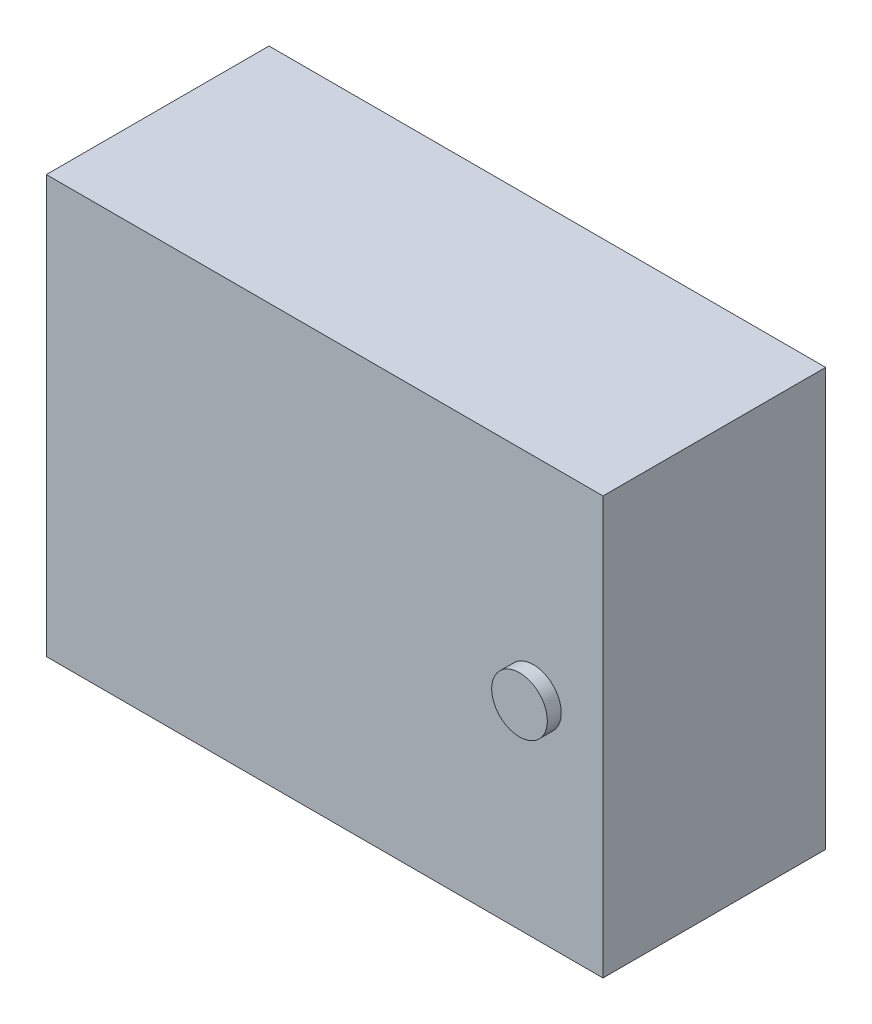
ISO-10303-21;
HEADER;
FILE_DESCRIPTION(('STEP AP214'),'2;1');
FILE_NAME('part.step','',(''),(''),'','','');
FILE_SCHEMA(('AUTOMOTIVE_DESIGN { 1 0 10303 214 1 1 1 1 }'));
ENDSEC;
DATA;
#1=APPLICATION_CONTEXT('core data for automotive mechanical design processes');
#2=APPLICATION_PROTOCOL_DEFINITION('international standard','automotive_design',2000,#1);
#3=PRODUCT_CONTEXT('',#1,'mechanical');
#4=PRODUCT('Part','Part','',(#3));
#5=PRODUCT_RELATED_PRODUCT_CATEGORY('part','',(#4));
#6=PRODUCT_DEFINITION_FORMATION('','',#4);
#7=PRODUCT_DEFINITION_CONTEXT('part definition',#1,'design');
#8=PRODUCT_DEFINITION('design','',#6,#7);
#9=PRODUCT_DEFINITION_SHAPE('','',#8);
#10=(LENGTH_UNIT() NAMED_UNIT(*) SI_UNIT(.MILLI.,.METRE.));
#11=(NAMED_UNIT(*) PLANE_ANGLE_UNIT() SI_UNIT($,.RADIAN.));
#12=(NAMED_UNIT(*) SI_UNIT($,.STERADIAN.) SOLID_ANGLE_UNIT());
#13=UNCERTAINTY_MEASURE_WITH_UNIT(LENGTH_MEASURE(1.E-05),#10,'distance_accuracy_value','');
#14=(GEOMETRIC_REPRESENTATION_CONTEXT(3) GLOBAL_UNCERTAINTY_ASSIGNED_CONTEXT((#13)) GLOBAL_UNIT_ASSIGNED_CONTEXT((#10,
#11,#12)) REPRESENTATION_CONTEXT('',''));
#15=CARTESIAN_POINT('',(0.,0.,0.));
#16=DIRECTION('',(0.,0.,1.));
#17=DIRECTION('',(1.,0.,0.));
#18=AXIS2_PLACEMENT_3D('',#15,#16,#17);
#19=CARTESIAN_POINT('',(200.,-150.,160.));
#20=DIRECTION('',(-1.,0.,0.));
#21=DIRECTION('',(0.,0.,1.));
#22=AXIS2_PLACEMENT_3D('',#19,#20,#21);
#23=PLANE('',#22);
#24=DIRECTION('',(0.,1.,0.));
#25=VECTOR('',#24,1.);
#26=CARTESIAN_POINT('',(200.,-150.,0.));
#27=LINE('',#26,#25);
#28=CARTESIAN_POINT('',(200.,-150.,0.));
#29=VERTEX_POINT('',#28);
#30=CARTESIAN_POINT('',(200.,150.,0.));
#31=VERTEX_POINT('',#30);
#32=EDGE_CURVE('E99',#29,#31,#27,.T.);
#33=ORIENTED_EDGE('',*,*,#32,.T.);
#34=DIRECTION('',(0.,0.,-1.));
#35=VECTOR('',#34,1.);
#36=CARTESIAN_POINT('',(200.,150.,160.));
#37=LINE('',#36,#35);
#38=CARTESIAN_POINT('',(200.,150.,160.));
#39=VERTEX_POINT('',#38);
#40=EDGE_CURVE('E41',#39,#31,#37,.T.);
#41=ORIENTED_EDGE('',*,*,#40,.F.);
#42=DIRECTION('',(0.,1.,0.));
#43=VECTOR('',#42,1.);
#44=CARTESIAN_POINT('',(200.,-150.,160.));
#45=LINE('',#44,#43);
#46=CARTESIAN_POINT('',(200.,-150.,160.));
#47=VERTEX_POINT('',#46);
#48=EDGE_CURVE('E85',#47,#39,#45,.T.);
#49=ORIENTED_EDGE('',*,*,#48,.F.);
#50=DIRECTION('',(0.,0.,-1.));
#51=VECTOR('',#50,1.);
#52=CARTESIAN_POINT('',(200.,-150.,160.));
#53=LINE('',#52,#51);
#54=EDGE_CURVE('E95',#47,#29,#53,.T.);
#55=ORIENTED_EDGE('',*,*,#54,.T.);
#56=EDGE_LOOP('',(#33,#41,#49,#55));
#57=FACE_BOUND('',#56,.T.);
#58=ADVANCED_FACE('F33',(#57),#23,.F.);
#59=CARTESIAN_POINT('',(-200.,150.,160.));
#60=DIRECTION('',(0.,-1.,0.));
#61=DIRECTION('',(0.,0.,-1.));
#62=AXIS2_PLACEMENT_3D('',#59,#60,#61);
#63=PLANE('',#62);
#64=DIRECTION('',(-1.,0.,0.));
#65=VECTOR('',#64,1.);
#66=CARTESIAN_POINT('',(-200.,150.,0.));
#67=LINE('',#66,#65);
#68=CARTESIAN_POINT('',(-200.,150.,0.));
#69=VERTEX_POINT('',#68);
#70=EDGE_CURVE('E90',#31,#69,#67,.T.);
#71=ORIENTED_EDGE('',*,*,#70,.T.);
#72=DIRECTION('',(0.,0.,-1.));
#73=VECTOR('',#72,1.);
#74=CARTESIAN_POINT('',(-200.,150.,160.));
#75=LINE('',#74,#73);
#76=CARTESIAN_POINT('',(-200.,150.,160.));
#77=VERTEX_POINT('',#76);
#78=EDGE_CURVE('E88',#77,#69,#75,.T.);
#79=ORIENTED_EDGE('',*,*,#78,.F.);
#80=DIRECTION('',(-1.,0.,0.));
#81=VECTOR('',#80,1.);
#82=CARTESIAN_POINT('',(-200.,150.,160.));
#83=LINE('',#82,#81);
#84=EDGE_CURVE('E80',#39,#77,#83,.T.);
#85=ORIENTED_EDGE('',*,*,#84,.F.);
#86=ORIENTED_EDGE('',*,*,#40,.T.);
#87=EDGE_LOOP('',(#71,#79,#85,#86));
#88=FACE_BOUND('',#87,.T.);
#89=ADVANCED_FACE('F89',(#88),#63,.F.);
#90=CARTESIAN_POINT('',(-200.,-150.,160.));
#91=DIRECTION('',(1.,0.,0.));
#92=DIRECTION('',(0.,0.,-1.));
#93=AXIS2_PLACEMENT_3D('',#90,#91,#92);
#94=PLANE('',#93);
#95=DIRECTION('',(0.,-1.,0.));
#96=VECTOR('',#95,1.);
#97=CARTESIAN_POINT('',(-200.,-150.,0.));
#98=LINE('',#97,#96);
#99=CARTESIAN_POINT('',(-200.,-150.,0.));
#100=VERTEX_POINT('',#99);
#101=EDGE_CURVE('E66',#69,#100,#98,.T.);
#102=ORIENTED_EDGE('',*,*,#101,.T.);
#103=DIRECTION('',(0.,0.,-1.));
#104=VECTOR('',#103,1.);
#105=CARTESIAN_POINT('',(-200.,-150.,160.));
#106=LINE('',#105,#104);
#107=CARTESIAN_POINT('',(-200.,-150.,160.));
#108=VERTEX_POINT('',#107);
#109=EDGE_CURVE('E91',#108,#100,#106,.T.);
#110=ORIENTED_EDGE('',*,*,#109,.F.);
#111=DIRECTION('',(0.,-1.,0.));
#112=VECTOR('',#111,1.);
#113=CARTESIAN_POINT('',(-200.,-150.,160.));
#114=LINE('',#113,#112);
#115=EDGE_CURVE('E83',#77,#108,#114,.T.);
#116=ORIENTED_EDGE('',*,*,#115,.F.);
#117=ORIENTED_EDGE('',*,*,#78,.T.);
#118=EDGE_LOOP('',(#102,#110,#116,#117));
#119=FACE_BOUND('',#118,.T.);
#120=ADVANCED_FACE('F93',(#119),#94,.F.);
#121=CARTESIAN_POINT('',(-200.,-150.,160.));
#122=DIRECTION('',(0.,1.,0.));
#123=DIRECTION('',(0.,0.,1.));
#124=AXIS2_PLACEMENT_3D('',#121,#122,#123);
#125=PLANE('',#124);
#126=DIRECTION('',(1.,0.,0.));
#127=VECTOR('',#126,1.);
#128=CARTESIAN_POINT('',(-200.,-150.,0.));
#129=LINE('',#128,#127);
#130=EDGE_CURVE('E72',#100,#29,#129,.T.);
#131=ORIENTED_EDGE('',*,*,#130,.T.);
#132=ORIENTED_EDGE('',*,*,#54,.F.);
#133=DIRECTION('',(1.,0.,0.));
#134=VECTOR('',#133,1.);
#135=CARTESIAN_POINT('',(-200.,-150.,160.));
#136=LINE('',#135,#134);
#137=EDGE_CURVE('E49',#108,#47,#136,.T.);
#138=ORIENTED_EDGE('',*,*,#137,.F.);
#139=ORIENTED_EDGE('',*,*,#109,.T.);
#140=EDGE_LOOP('',(#131,#132,#138,#139));
#141=FACE_BOUND('',#140,.T.);
#142=ADVANCED_FACE('F121',(#141),#125,.F.);
#143=CARTESIAN_POINT('',(0.,0.,160.));
#144=DIRECTION('',(0.,0.,-1.));
#145=DIRECTION('',(-1.,0.,0.));
#146=AXIS2_PLACEMENT_3D('',#143,#144,#145);
#147=PLANE('',#146);
#148=CARTESIAN_POINT('',(150.,0.,160.));
#149=DIRECTION('',(0.,0.,-1.));
#150=DIRECTION('',(-1.,0.,0.));
#151=AXIS2_PLACEMENT_3D('',#148,#149,#150);
#152=CIRCLE('',#151,20.);
#153=CARTESIAN_POINT('',(130.,0.,160.));
#154=VERTEX_POINT('',#153);
#155=EDGE_CURVE('E11',#154,#154,#152,.F.);
#156=ORIENTED_EDGE('',*,*,#155,.F.);
#157=EDGE_LOOP('',(#156));
#158=FACE_BOUND('',#157,.T.);
#159=ORIENTED_EDGE('',*,*,#48,.T.);
#160=ORIENTED_EDGE('',*,*,#84,.T.);
#161=ORIENTED_EDGE('',*,*,#115,.T.);
#162=ORIENTED_EDGE('',*,*,#137,.T.);
#163=EDGE_LOOP('',(#159,#160,#161,#162));
#164=FACE_BOUND('',#163,.T.);
#165=ADVANCED_FACE('F81',(#158,#164),#147,.F.);
#166=CARTESIAN_POINT('',(0.,0.,0.));
#167=DIRECTION('',(0.,0.,-1.));
#168=DIRECTION('',(-1.,0.,0.));
#169=AXIS2_PLACEMENT_3D('',#166,#167,#168);
#170=PLANE('',#169);
#171=ORIENTED_EDGE('',*,*,#32,.F.);
#172=ORIENTED_EDGE('',*,*,#130,.F.);
#173=ORIENTED_EDGE('',*,*,#101,.F.);
#174=ORIENTED_EDGE('',*,*,#70,.F.);
#175=EDGE_LOOP('',(#171,#172,#173,#174));
#176=FACE_BOUND('',#175,.T.);
#177=ADVANCED_FACE('F110',(#176),#170,.T.);
#178=CARTESIAN_POINT('',(150.,0.,170.));
#179=DIRECTION('',(0.,0.,-1.));
#180=DIRECTION('',(-1.,0.,0.));
#181=AXIS2_PLACEMENT_3D('',#178,#179,#180);
#182=CYLINDRICAL_SURFACE('',#181,20.);
#183=CARTESIAN_POINT('',(150.,0.,170.));
#184=DIRECTION('',(0.,0.,1.));
#185=DIRECTION('',(1.,0.,0.));
#186=AXIS2_PLACEMENT_3D('',#183,#184,#185);
#187=CIRCLE('',#186,20.);
#188=CARTESIAN_POINT('',(170.,0.,170.));
#189=VERTEX_POINT('',#188);
#190=EDGE_CURVE('E102',#189,#189,#187,.T.);
#191=ORIENTED_EDGE('',*,*,#190,.F.);
#192=EDGE_LOOP('',(#191));
#193=FACE_BOUND('',#192,.T.);
#194=ORIENTED_EDGE('',*,*,#155,.T.);
#195=EDGE_LOOP('',(#194));
#196=FACE_BOUND('',#195,.T.);
#197=ADVANCED_FACE('F112',(#193,#196),#182,.T.);
#198=CARTESIAN_POINT('',(150.,0.,170.));
#199=DIRECTION('',(0.,0.,1.));
#200=DIRECTION('',(1.,0.,0.));
#201=AXIS2_PLACEMENT_3D('',#198,#199,#200);
#202=PLANE('',#201);
#203=ORIENTED_EDGE('',*,*,#190,.T.);
#204=EDGE_LOOP('',(#203));
#205=FACE_BOUND('',#204,.T.);
#206=ADVANCED_FACE('F118',(#205),#202,.T.);
#207=CLOSED_SHELL('',(#58,#89,#120,#142,#165,#177,#197,#206));
#208=MANIFOLD_SOLID_BREP('B2',#207);
#209=ADVANCED_BREP_SHAPE_REPRESENTATION('',(#18,#208),#14);
#210=SHAPE_DEFINITION_REPRESENTATION(#9,#209);
ENDSEC;
END-ISO-10303-21;
